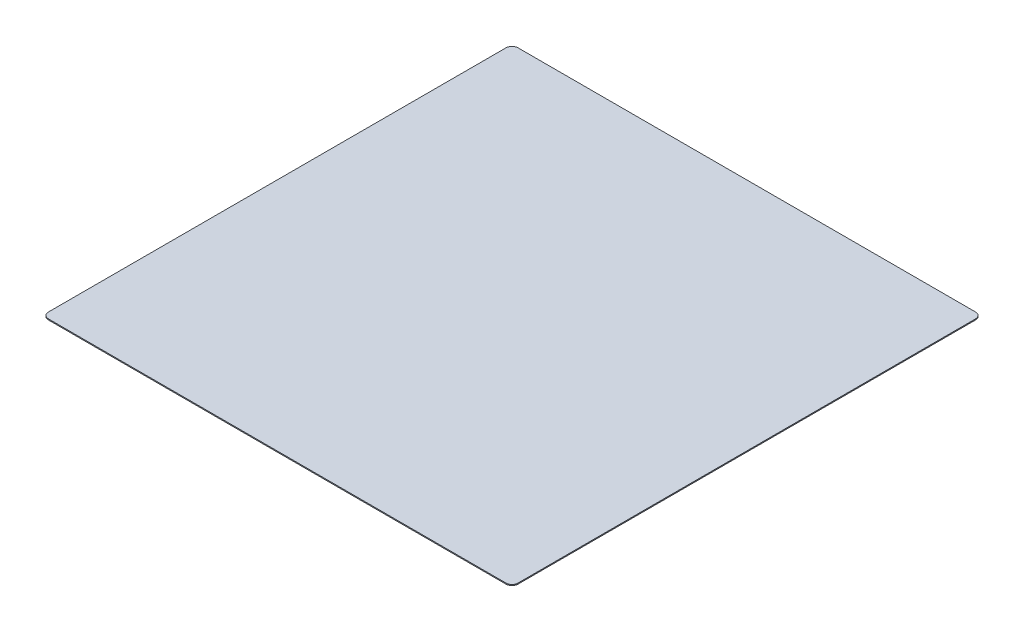
ISO-10303-21;
HEADER;
FILE_DESCRIPTION(('STEP AP214'),'2;1');
FILE_NAME('part.step','',(''),(''),'','','');
FILE_SCHEMA(('AUTOMOTIVE_DESIGN { 1 0 10303 214 1 1 1 1 }'));
ENDSEC;
DATA;
#1=APPLICATION_CONTEXT('core data for automotive mechanical design processes');
#2=APPLICATION_PROTOCOL_DEFINITION('international standard','automotive_design',2000,#1);
#3=PRODUCT_CONTEXT('',#1,'mechanical');
#4=PRODUCT('Part','Part','',(#3));
#5=PRODUCT_RELATED_PRODUCT_CATEGORY('part','',(#4));
#6=PRODUCT_DEFINITION_FORMATION('','',#4);
#7=PRODUCT_DEFINITION_CONTEXT('part definition',#1,'design');
#8=PRODUCT_DEFINITION('design','',#6,#7);
#9=PRODUCT_DEFINITION_SHAPE('','',#8);
#10=(LENGTH_UNIT() NAMED_UNIT(*) SI_UNIT(.MILLI.,.METRE.));
#11=(NAMED_UNIT(*) PLANE_ANGLE_UNIT() SI_UNIT($,.RADIAN.));
#12=(NAMED_UNIT(*) SI_UNIT($,.STERADIAN.) SOLID_ANGLE_UNIT());
#13=UNCERTAINTY_MEASURE_WITH_UNIT(LENGTH_MEASURE(1.E-05),#10,'distance_accuracy_value','');
#14=(GEOMETRIC_REPRESENTATION_CONTEXT(3) GLOBAL_UNCERTAINTY_ASSIGNED_CONTEXT((#13)) GLOBAL_UNIT_ASSIGNED_CONTEXT((#10,
#11,#12)) REPRESENTATION_CONTEXT('',''));
#15=CARTESIAN_POINT('',(0.,0.,0.));
#16=DIRECTION('',(0.,0.,1.));
#17=DIRECTION('',(1.,0.,0.));
#18=AXIS2_PLACEMENT_3D('',#15,#16,#17);
#19=CARTESIAN_POINT('',(-114.5,0.5,114.5));
#20=DIRECTION('',(0.,-1.,0.));
#21=DIRECTION('',(0.,0.,-1.));
#22=AXIS2_PLACEMENT_3D('',#19,#20,#21);
#23=CYLINDRICAL_SURFACE('',#22,3.);
#24=CARTESIAN_POINT('',(-114.5,0.,114.5));
#25=DIRECTION('',(0.,1.,0.));
#26=DIRECTION('',(0.,0.,1.));
#27=AXIS2_PLACEMENT_3D('',#24,#25,#26);
#28=CIRCLE('',#27,3.);
#29=CARTESIAN_POINT('',(-117.5,0.,114.5));
#30=VERTEX_POINT('',#29);
#31=CARTESIAN_POINT('',(-114.5,0.,117.5));
#32=VERTEX_POINT('',#31);
#33=EDGE_CURVE('E130',#30,#32,#28,.T.);
#34=ORIENTED_EDGE('',*,*,#33,.T.);
#35=DIRECTION('',(0.,-1.,0.));
#36=VECTOR('',#35,1.);
#37=CARTESIAN_POINT('',(-114.5,0.5,117.5));
#38=LINE('',#37,#36);
#39=CARTESIAN_POINT('',(-114.5,0.5,117.5));
#40=VERTEX_POINT('',#39);
#41=EDGE_CURVE('E11',#40,#32,#38,.T.);
#42=ORIENTED_EDGE('',*,*,#41,.F.);
#43=CARTESIAN_POINT('',(-114.5,0.5,114.5));
#44=DIRECTION('',(0.,1.,0.));
#45=DIRECTION('',(0.,0.,1.));
#46=AXIS2_PLACEMENT_3D('',#43,#44,#45);
#47=CIRCLE('',#46,3.);
#48=CARTESIAN_POINT('',(-117.5,0.5,114.5));
#49=VERTEX_POINT('',#48);
#50=EDGE_CURVE('E144',#49,#40,#47,.T.);
#51=ORIENTED_EDGE('',*,*,#50,.F.);
#52=DIRECTION('',(0.,-1.,0.));
#53=VECTOR('',#52,1.);
#54=CARTESIAN_POINT('',(-117.5,0.5,114.5));
#55=LINE('',#54,#53);
#56=EDGE_CURVE('E126',#49,#30,#55,.T.);
#57=ORIENTED_EDGE('',*,*,#56,.T.);
#58=EDGE_LOOP('',(#34,#42,#51,#57));
#59=FACE_BOUND('',#58,.T.);
#60=ADVANCED_FACE('F34',(#59),#23,.T.);
#61=CARTESIAN_POINT('',(-114.5,0.5,117.5));
#62=DIRECTION('',(0.,0.,-1.));
#63=DIRECTION('',(-1.,0.,0.));
#64=AXIS2_PLACEMENT_3D('',#61,#62,#63);
#65=PLANE('',#64);
#66=DIRECTION('',(1.,0.,0.));
#67=VECTOR('',#66,1.);
#68=CARTESIAN_POINT('',(-114.5,0.,117.5));
#69=LINE('',#68,#67);
#70=CARTESIAN_POINT('',(114.5,0.,117.5));
#71=VERTEX_POINT('',#70);
#72=EDGE_CURVE('E133',#32,#71,#69,.T.);
#73=ORIENTED_EDGE('',*,*,#72,.T.);
#74=DIRECTION('',(0.,-1.,0.));
#75=VECTOR('',#74,1.);
#76=CARTESIAN_POINT('',(114.5,0.5,117.5));
#77=LINE('',#76,#75);
#78=CARTESIAN_POINT('',(114.5,0.5,117.5));
#79=VERTEX_POINT('',#78);
#80=EDGE_CURVE('E42',#79,#71,#77,.T.);
#81=ORIENTED_EDGE('',*,*,#80,.F.);
#82=DIRECTION('',(1.,0.,0.));
#83=VECTOR('',#82,1.);
#84=CARTESIAN_POINT('',(-114.5,0.5,117.5));
#85=LINE('',#84,#83);
#86=EDGE_CURVE('E93',#40,#79,#85,.T.);
#87=ORIENTED_EDGE('',*,*,#86,.F.);
#88=ORIENTED_EDGE('',*,*,#41,.T.);
#89=EDGE_LOOP('',(#73,#81,#87,#88));
#90=FACE_BOUND('',#89,.T.);
#91=ADVANCED_FACE('F179',(#90),#65,.F.);
#92=CARTESIAN_POINT('',(114.5,0.5,114.5));
#93=DIRECTION('',(0.,-1.,0.));
#94=DIRECTION('',(0.,0.,-1.));
#95=AXIS2_PLACEMENT_3D('',#92,#93,#94);
#96=CYLINDRICAL_SURFACE('',#95,3.);
#97=CARTESIAN_POINT('',(114.5,0.,114.5));
#98=DIRECTION('',(0.,1.,0.));
#99=DIRECTION('',(0.,0.,1.));
#100=AXIS2_PLACEMENT_3D('',#97,#98,#99);
#101=CIRCLE('',#100,3.);
#102=CARTESIAN_POINT('',(117.5,0.,114.5));
#103=VERTEX_POINT('',#102);
#104=EDGE_CURVE('E135',#71,#103,#101,.T.);
#105=ORIENTED_EDGE('',*,*,#104,.T.);
#106=DIRECTION('',(0.,-1.,0.));
#107=VECTOR('',#106,1.);
#108=CARTESIAN_POINT('',(117.5,0.5,114.5));
#109=LINE('',#108,#107);
#110=CARTESIAN_POINT('',(117.5,0.5,114.5));
#111=VERTEX_POINT('',#110);
#112=EDGE_CURVE('E151',#111,#103,#109,.T.);
#113=ORIENTED_EDGE('',*,*,#112,.F.);
#114=CARTESIAN_POINT('',(114.5,0.5,114.5));
#115=DIRECTION('',(0.,1.,0.));
#116=DIRECTION('',(0.,0.,1.));
#117=AXIS2_PLACEMENT_3D('',#114,#115,#116);
#118=CIRCLE('',#117,3.);
#119=EDGE_CURVE('E159',#79,#111,#118,.T.);
#120=ORIENTED_EDGE('',*,*,#119,.F.);
#121=ORIENTED_EDGE('',*,*,#80,.T.);
#122=EDGE_LOOP('',(#105,#113,#120,#121));
#123=FACE_BOUND('',#122,.T.);
#124=ADVANCED_FACE('F157',(#123),#96,.T.);
#125=CARTESIAN_POINT('',(117.5,0.5,114.5));
#126=DIRECTION('',(-1.,0.,0.));
#127=DIRECTION('',(0.,0.,1.));
#128=AXIS2_PLACEMENT_3D('',#125,#126,#127);
#129=PLANE('',#128);
#130=DIRECTION('',(0.,0.,-1.));
#131=VECTOR('',#130,1.);
#132=CARTESIAN_POINT('',(117.5,0.,114.5));
#133=LINE('',#132,#131);
#134=CARTESIAN_POINT('',(117.5,0.,-114.5));
#135=VERTEX_POINT('',#134);
#136=EDGE_CURVE('E137',#103,#135,#133,.T.);
#137=ORIENTED_EDGE('',*,*,#136,.T.);
#138=DIRECTION('',(0.,-1.,0.));
#139=VECTOR('',#138,1.);
#140=CARTESIAN_POINT('',(117.5,0.5,-114.5));
#141=LINE('',#140,#139);
#142=CARTESIAN_POINT('',(117.5,0.5,-114.5));
#143=VERTEX_POINT('',#142);
#144=EDGE_CURVE('E148',#143,#135,#141,.T.);
#145=ORIENTED_EDGE('',*,*,#144,.F.);
#146=DIRECTION('',(0.,0.,-1.));
#147=VECTOR('',#146,1.);
#148=CARTESIAN_POINT('',(117.5,0.5,114.5));
#149=LINE('',#148,#147);
#150=EDGE_CURVE('E171',#111,#143,#149,.T.);
#151=ORIENTED_EDGE('',*,*,#150,.F.);
#152=ORIENTED_EDGE('',*,*,#112,.T.);
#153=EDGE_LOOP('',(#137,#145,#151,#152));
#154=FACE_BOUND('',#153,.T.);
#155=ADVANCED_FACE('F167',(#154),#129,.F.);
#156=CARTESIAN_POINT('',(114.5,0.5,-114.5));
#157=DIRECTION('',(0.,-1.,0.));
#158=DIRECTION('',(0.,0.,-1.));
#159=AXIS2_PLACEMENT_3D('',#156,#157,#158);
#160=CYLINDRICAL_SURFACE('',#159,3.);
#161=CARTESIAN_POINT('',(114.5,0.,-114.5));
#162=DIRECTION('',(0.,1.,0.));
#163=DIRECTION('',(0.,0.,1.));
#164=AXIS2_PLACEMENT_3D('',#161,#162,#163);
#165=CIRCLE('',#164,3.);
#166=CARTESIAN_POINT('',(114.5,0.,-117.5));
#167=VERTEX_POINT('',#166);
#168=EDGE_CURVE('E139',#135,#167,#165,.T.);
#169=ORIENTED_EDGE('',*,*,#168,.T.);
#170=DIRECTION('',(0.,-1.,0.));
#171=VECTOR('',#170,1.);
#172=CARTESIAN_POINT('',(114.5,0.5,-117.5));
#173=LINE('',#172,#171);
#174=CARTESIAN_POINT('',(114.5,0.5,-117.5));
#175=VERTEX_POINT('',#174);
#176=EDGE_CURVE('E121',#175,#167,#173,.T.);
#177=ORIENTED_EDGE('',*,*,#176,.F.);
#178=CARTESIAN_POINT('',(114.5,0.5,-114.5));
#179=DIRECTION('',(0.,1.,0.));
#180=DIRECTION('',(0.,0.,1.));
#181=AXIS2_PLACEMENT_3D('',#178,#179,#180);
#182=CIRCLE('',#181,3.);
#183=EDGE_CURVE('E112',#143,#175,#182,.T.);
#184=ORIENTED_EDGE('',*,*,#183,.F.);
#185=ORIENTED_EDGE('',*,*,#144,.T.);
#186=EDGE_LOOP('',(#169,#177,#184,#185));
#187=FACE_BOUND('',#186,.T.);
#188=ADVANCED_FACE('F170',(#187),#160,.T.);
#189=CARTESIAN_POINT('',(114.5,0.5,-117.5));
#190=DIRECTION('',(0.,0.,1.));
#191=DIRECTION('',(1.,0.,0.));
#192=AXIS2_PLACEMENT_3D('',#189,#190,#191);
#193=PLANE('',#192);
#194=DIRECTION('',(-1.,0.,0.));
#195=VECTOR('',#194,1.);
#196=CARTESIAN_POINT('',(114.5,0.,-117.5));
#197=LINE('',#196,#195);
#198=CARTESIAN_POINT('',(-114.5,0.,-117.5));
#199=VERTEX_POINT('',#198);
#200=EDGE_CURVE('E120',#167,#199,#197,.T.);
#201=ORIENTED_EDGE('',*,*,#200,.T.);
#202=DIRECTION('',(0.,-1.,0.));
#203=VECTOR('',#202,1.);
#204=CARTESIAN_POINT('',(-114.5,0.5,-117.5));
#205=LINE('',#204,#203);
#206=CARTESIAN_POINT('',(-114.5,0.5,-117.5));
#207=VERTEX_POINT('',#206);
#208=EDGE_CURVE('E117',#207,#199,#205,.T.);
#209=ORIENTED_EDGE('',*,*,#208,.F.);
#210=DIRECTION('',(-1.,0.,0.));
#211=VECTOR('',#210,1.);
#212=CARTESIAN_POINT('',(114.5,0.5,-117.5));
#213=LINE('',#212,#211);
#214=EDGE_CURVE('E106',#175,#207,#213,.T.);
#215=ORIENTED_EDGE('',*,*,#214,.F.);
#216=ORIENTED_EDGE('',*,*,#176,.T.);
#217=EDGE_LOOP('',(#201,#209,#215,#216));
#218=FACE_BOUND('',#217,.T.);
#219=ADVANCED_FACE('F118',(#218),#193,.F.);
#220=CARTESIAN_POINT('',(-114.5,0.5,-114.5));
#221=DIRECTION('',(0.,-1.,0.));
#222=DIRECTION('',(0.,0.,-1.));
#223=AXIS2_PLACEMENT_3D('',#220,#221,#222);
#224=CYLINDRICAL_SURFACE('',#223,3.);
#225=CARTESIAN_POINT('',(-114.5,0.,-114.5));
#226=DIRECTION('',(0.,1.,0.));
#227=DIRECTION('',(0.,0.,1.));
#228=AXIS2_PLACEMENT_3D('',#225,#226,#227);
#229=CIRCLE('',#228,3.);
#230=CARTESIAN_POINT('',(-117.5,0.,-114.5));
#231=VERTEX_POINT('',#230);
#232=EDGE_CURVE('E79',#199,#231,#229,.T.);
#233=ORIENTED_EDGE('',*,*,#232,.T.);
#234=DIRECTION('',(0.,-1.,0.));
#235=VECTOR('',#234,1.);
#236=CARTESIAN_POINT('',(-117.5,0.5,-114.5));
#237=LINE('',#236,#235);
#238=CARTESIAN_POINT('',(-117.5,0.5,-114.5));
#239=VERTEX_POINT('',#238);
#240=EDGE_CURVE('E122',#239,#231,#237,.T.);
#241=ORIENTED_EDGE('',*,*,#240,.F.);
#242=CARTESIAN_POINT('',(-114.5,0.5,-114.5));
#243=DIRECTION('',(0.,1.,0.));
#244=DIRECTION('',(0.,0.,1.));
#245=AXIS2_PLACEMENT_3D('',#242,#243,#244);
#246=CIRCLE('',#245,3.);
#247=EDGE_CURVE('E110',#207,#239,#246,.T.);
#248=ORIENTED_EDGE('',*,*,#247,.F.);
#249=ORIENTED_EDGE('',*,*,#208,.T.);
#250=EDGE_LOOP('',(#233,#241,#248,#249));
#251=FACE_BOUND('',#250,.T.);
#252=ADVANCED_FACE('F124',(#251),#224,.T.);
#253=CARTESIAN_POINT('',(-117.5,0.5,-114.5));
#254=DIRECTION('',(1.,0.,0.));
#255=DIRECTION('',(0.,0.,-1.));
#256=AXIS2_PLACEMENT_3D('',#253,#254,#255);
#257=PLANE('',#256);
#258=DIRECTION('',(0.,0.,1.));
#259=VECTOR('',#258,1.);
#260=CARTESIAN_POINT('',(-117.5,0.,-114.5));
#261=LINE('',#260,#259);
#262=EDGE_CURVE('E85',#231,#30,#261,.T.);
#263=ORIENTED_EDGE('',*,*,#262,.T.);
#264=ORIENTED_EDGE('',*,*,#56,.F.);
#265=DIRECTION('',(0.,0.,1.));
#266=VECTOR('',#265,1.);
#267=CARTESIAN_POINT('',(-117.5,0.5,-114.5));
#268=LINE('',#267,#266);
#269=EDGE_CURVE('E50',#239,#49,#268,.T.);
#270=ORIENTED_EDGE('',*,*,#269,.F.);
#271=ORIENTED_EDGE('',*,*,#240,.T.);
#272=EDGE_LOOP('',(#263,#264,#270,#271));
#273=FACE_BOUND('',#272,.T.);
#274=ADVANCED_FACE('F195',(#273),#257,.F.);
#275=CARTESIAN_POINT('',(-114.5,0.5,114.5));
#276=DIRECTION('',(0.,1.,0.));
#277=DIRECTION('',(0.,0.,1.));
#278=AXIS2_PLACEMENT_3D('',#275,#276,#277);
#279=PLANE('',#278);
#280=ORIENTED_EDGE('',*,*,#50,.T.);
#281=ORIENTED_EDGE('',*,*,#86,.T.);
#282=ORIENTED_EDGE('',*,*,#119,.T.);
#283=ORIENTED_EDGE('',*,*,#150,.T.);
#284=ORIENTED_EDGE('',*,*,#183,.T.);
#285=ORIENTED_EDGE('',*,*,#214,.T.);
#286=ORIENTED_EDGE('',*,*,#247,.T.);
#287=ORIENTED_EDGE('',*,*,#269,.T.);
#288=EDGE_LOOP('',(#280,#281,#282,#283,#284,#285,#286,#287));
#289=FACE_BOUND('',#288,.T.);
#290=ADVANCED_FACE('F108',(#289),#279,.T.);
#291=CARTESIAN_POINT('',(-114.5,0.,114.5));
#292=DIRECTION('',(0.,1.,0.));
#293=DIRECTION('',(0.,0.,1.));
#294=AXIS2_PLACEMENT_3D('',#291,#292,#293);
#295=PLANE('',#294);
#296=ORIENTED_EDGE('',*,*,#33,.F.);
#297=ORIENTED_EDGE('',*,*,#262,.F.);
#298=ORIENTED_EDGE('',*,*,#232,.F.);
#299=ORIENTED_EDGE('',*,*,#200,.F.);
#300=ORIENTED_EDGE('',*,*,#168,.F.);
#301=ORIENTED_EDGE('',*,*,#136,.F.);
#302=ORIENTED_EDGE('',*,*,#104,.F.);
#303=ORIENTED_EDGE('',*,*,#72,.F.);
#304=EDGE_LOOP('',(#296,#297,#298,#299,#300,#301,#302,#303));
#305=FACE_BOUND('',#304,.T.);
#306=ADVANCED_FACE('F163',(#305),#295,.F.);
#307=CLOSED_SHELL('',(#60,#91,#124,#155,#188,#219,#252,#274,#290,#306));
#308=MANIFOLD_SOLID_BREP('B2',#307);
#309=ADVANCED_BREP_SHAPE_REPRESENTATION('',(#18,#308),#14);
#310=SHAPE_DEFINITION_REPRESENTATION(#9,#309);
ENDSEC;
END-ISO-10303-21;
